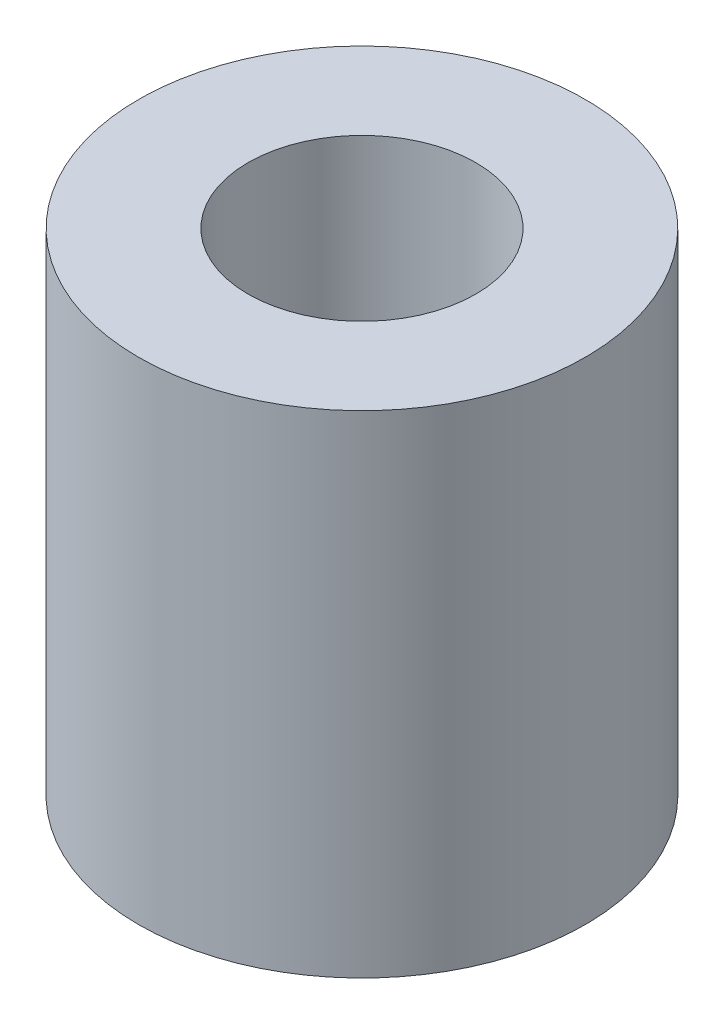
ISO-10303-21;
HEADER;
FILE_DESCRIPTION(('STEP AP214'),'2;1');
FILE_NAME('part.step','',(''),(''),'','','');
FILE_SCHEMA(('AUTOMOTIVE_DESIGN { 1 0 10303 214 1 1 1 1 }'));
ENDSEC;
DATA;
#1=APPLICATION_CONTEXT('core data for automotive mechanical design processes');
#2=APPLICATION_PROTOCOL_DEFINITION('international standard','automotive_design',2000,#1);
#3=PRODUCT_CONTEXT('',#1,'mechanical');
#4=PRODUCT('Part','Part','',(#3));
#5=PRODUCT_RELATED_PRODUCT_CATEGORY('part','',(#4));
#6=PRODUCT_DEFINITION_FORMATION('','',#4);
#7=PRODUCT_DEFINITION_CONTEXT('part definition',#1,'design');
#8=PRODUCT_DEFINITION('design','',#6,#7);
#9=PRODUCT_DEFINITION_SHAPE('','',#8);
#10=(LENGTH_UNIT() NAMED_UNIT(*) SI_UNIT(.MILLI.,.METRE.));
#11=(NAMED_UNIT(*) PLANE_ANGLE_UNIT() SI_UNIT($,.RADIAN.));
#12=(NAMED_UNIT(*) SI_UNIT($,.STERADIAN.) SOLID_ANGLE_UNIT());
#13=UNCERTAINTY_MEASURE_WITH_UNIT(LENGTH_MEASURE(1.E-05),#10,'distance_accuracy_value','');
#14=(GEOMETRIC_REPRESENTATION_CONTEXT(3) GLOBAL_UNCERTAINTY_ASSIGNED_CONTEXT((#13)) GLOBAL_UNIT_ASSIGNED_CONTEXT((#10,
#11,#12)) REPRESENTATION_CONTEXT('',''));
#15=CARTESIAN_POINT('',(0.,0.,0.));
#16=DIRECTION('',(0.,0.,1.));
#17=DIRECTION('',(1.,0.,0.));
#18=AXIS2_PLACEMENT_3D('',#15,#16,#17);
#19=CARTESIAN_POINT('',(0.,11.,0.));
#20=DIRECTION('',(0.,1.,0.));
#21=DIRECTION('',(0.,0.,1.));
#22=AXIS2_PLACEMENT_3D('',#19,#20,#21);
#23=PLANE('',#22);
#24=CARTESIAN_POINT('',(0.,11.,0.));
#25=DIRECTION('',(0.,1.,0.));
#26=DIRECTION('',(0.,0.,1.));
#27=AXIS2_PLACEMENT_3D('',#24,#25,#26);
#28=CIRCLE('',#27,5.);
#29=CARTESIAN_POINT('',(0.,11.,5.));
#30=VERTEX_POINT('',#29);
#31=EDGE_CURVE('E10',#30,#30,#28,.T.);
#32=ORIENTED_EDGE('',*,*,#31,.T.);
#33=EDGE_LOOP('',(#32));
#34=FACE_BOUND('',#33,.T.);
#35=CARTESIAN_POINT('',(0.,11.,0.));
#36=DIRECTION('',(0.,1.,0.));
#37=DIRECTION('',(0.,0.,1.));
#38=AXIS2_PLACEMENT_3D('',#35,#36,#37);
#39=CIRCLE('',#38,2.55);
#40=CARTESIAN_POINT('',(0.,11.,2.55));
#41=VERTEX_POINT('',#40);
#42=EDGE_CURVE('E42',#41,#41,#39,.T.);
#43=ORIENTED_EDGE('',*,*,#42,.F.);
#44=EDGE_LOOP('',(#43));
#45=FACE_BOUND('',#44,.T.);
#46=ADVANCED_FACE('F31',(#34,#45),#23,.T.);
#47=CARTESIAN_POINT('',(0.,0.,0.));
#48=DIRECTION('',(0.,1.,0.));
#49=DIRECTION('',(0.,0.,1.));
#50=AXIS2_PLACEMENT_3D('',#47,#48,#49);
#51=PLANE('',#50);
#52=CARTESIAN_POINT('',(0.,0.,0.));
#53=DIRECTION('',(0.,1.,0.));
#54=DIRECTION('',(0.,0.,1.));
#55=AXIS2_PLACEMENT_3D('',#52,#53,#54);
#56=CIRCLE('',#55,5.);
#57=CARTESIAN_POINT('',(0.,0.,5.));
#58=VERTEX_POINT('',#57);
#59=EDGE_CURVE('E35',#58,#58,#56,.T.);
#60=ORIENTED_EDGE('',*,*,#59,.F.);
#61=EDGE_LOOP('',(#60));
#62=FACE_BOUND('',#61,.T.);
#63=CARTESIAN_POINT('',(0.,0.,0.));
#64=DIRECTION('',(0.,1.,0.));
#65=DIRECTION('',(0.,0.,1.));
#66=AXIS2_PLACEMENT_3D('',#63,#64,#65);
#67=CIRCLE('',#66,2.55);
#68=CARTESIAN_POINT('',(0.,0.,2.55));
#69=VERTEX_POINT('',#68);
#70=EDGE_CURVE('E44',#69,#69,#67,.T.);
#71=ORIENTED_EDGE('',*,*,#70,.T.);
#72=EDGE_LOOP('',(#71));
#73=FACE_BOUND('',#72,.T.);
#74=ADVANCED_FACE('F54',(#62,#73),#51,.F.);
#75=CARTESIAN_POINT('',(0.,11.,0.));
#76=DIRECTION('',(0.,-1.,0.));
#77=DIRECTION('',(0.,0.,-1.));
#78=AXIS2_PLACEMENT_3D('',#75,#76,#77);
#79=CYLINDRICAL_SURFACE('',#78,5.);
#80=ORIENTED_EDGE('',*,*,#31,.F.);
#81=EDGE_LOOP('',(#80));
#82=FACE_BOUND('',#81,.T.);
#83=ORIENTED_EDGE('',*,*,#59,.T.);
#84=EDGE_LOOP('',(#83));
#85=FACE_BOUND('',#84,.T.);
#86=ADVANCED_FACE('F33',(#82,#85),#79,.T.);
#87=CARTESIAN_POINT('',(0.,11.,0.));
#88=DIRECTION('',(0.,-1.,0.));
#89=DIRECTION('',(0.,0.,-1.));
#90=AXIS2_PLACEMENT_3D('',#87,#88,#89);
#91=CYLINDRICAL_SURFACE('',#90,2.55);
#92=ORIENTED_EDGE('',*,*,#42,.T.);
#93=EDGE_LOOP('',(#92));
#94=FACE_BOUND('',#93,.T.);
#95=ORIENTED_EDGE('',*,*,#70,.F.);
#96=EDGE_LOOP('',(#95));
#97=FACE_BOUND('',#96,.T.);
#98=ADVANCED_FACE('F50',(#94,#97),#91,.F.);
#99=CLOSED_SHELL('',(#46,#74,#86,#98));
#100=MANIFOLD_SOLID_BREP('B2',#99);
#101=ADVANCED_BREP_SHAPE_REPRESENTATION('',(#18,#100),#14);
#102=SHAPE_DEFINITION_REPRESENTATION(#9,#101);
ENDSEC;
END-ISO-10303-21;
